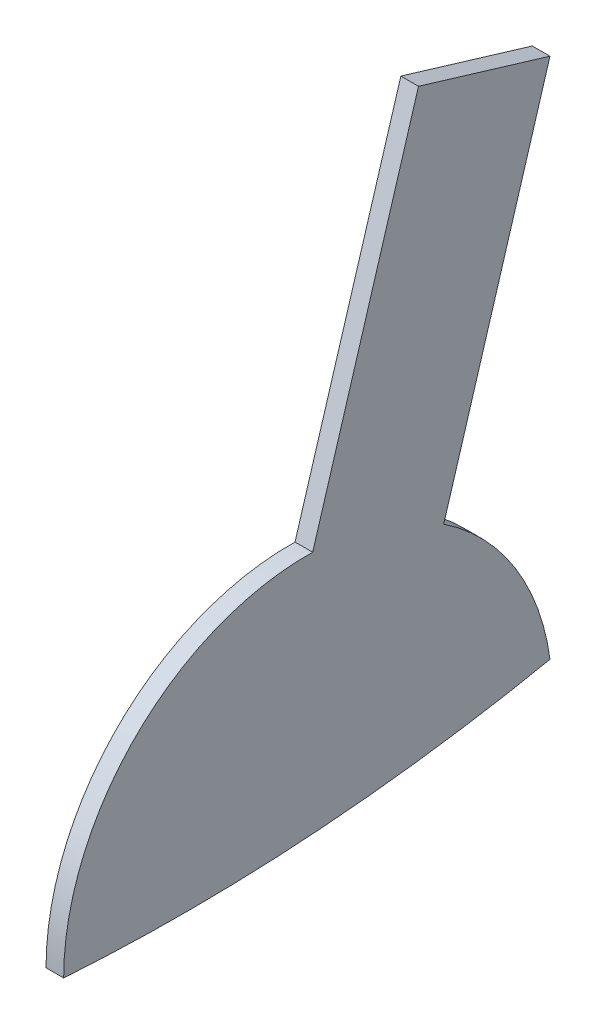
ISO-10303-21;
HEADER;
FILE_DESCRIPTION(('STEP AP214'),'2;1');
FILE_NAME('part.step','',(''),(''),'','','');
FILE_SCHEMA(('AUTOMOTIVE_DESIGN { 1 0 10303 214 1 1 1 1 }'));
ENDSEC;
DATA;
#1=APPLICATION_CONTEXT('core data for automotive mechanical design processes');
#2=APPLICATION_PROTOCOL_DEFINITION('international standard','automotive_design',2000,#1);
#3=PRODUCT_CONTEXT('',#1,'mechanical');
#4=PRODUCT('Part','Part','',(#3));
#5=PRODUCT_RELATED_PRODUCT_CATEGORY('part','',(#4));
#6=PRODUCT_DEFINITION_FORMATION('','',#4);
#7=PRODUCT_DEFINITION_CONTEXT('part definition',#1,'design');
#8=PRODUCT_DEFINITION('design','',#6,#7);
#9=PRODUCT_DEFINITION_SHAPE('','',#8);
#10=(LENGTH_UNIT() NAMED_UNIT(*) SI_UNIT(.MILLI.,.METRE.));
#11=(NAMED_UNIT(*) PLANE_ANGLE_UNIT() SI_UNIT($,.RADIAN.));
#12=(NAMED_UNIT(*) SI_UNIT($,.STERADIAN.) SOLID_ANGLE_UNIT());
#13=UNCERTAINTY_MEASURE_WITH_UNIT(LENGTH_MEASURE(1.E-05),#10,'distance_accuracy_value','');
#14=(GEOMETRIC_REPRESENTATION_CONTEXT(3) GLOBAL_UNCERTAINTY_ASSIGNED_CONTEXT((#13)) GLOBAL_UNIT_ASSIGNED_CONTEXT((#10,
#11,#12)) REPRESENTATION_CONTEXT('',''));
#15=CARTESIAN_POINT('',(0.,0.,0.));
#16=DIRECTION('',(0.,0.,1.));
#17=DIRECTION('',(1.,0.,0.));
#18=AXIS2_PLACEMENT_3D('',#15,#16,#17);
#19=CARTESIAN_POINT('',(-1.5,94.3547100362037,-41.1404397093335));
#20=DIRECTION('',(0.,0.957335683944895,-0.288978179532228));
#21=DIRECTION('',(0.,0.288978179532228,0.957335683944895));
#22=AXIS2_PLACEMENT_3D('',#19,#20,#21);
#23=PLANE('',#22);
#24=DIRECTION('',(0.,0.288978179532228,0.957335683944895));
#25=VECTOR('',#24,1.);
#26=CARTESIAN_POINT('',(1.5,94.3547100362037,-41.1404397093335));
#27=LINE('',#26,#25);
#28=CARTESIAN_POINT('',(1.5,94.3547100362037,-41.1404397093335));
#29=VERTEX_POINT('',#28);
#30=CARTESIAN_POINT('',(1.5,101.100096823698,-18.7941176301657));
#31=VERTEX_POINT('',#30);
#32=EDGE_CURVE('E148',#29,#31,#27,.T.);
#33=ORIENTED_EDGE('',*,*,#32,.F.);
#34=DIRECTION('',(1.,0.,0.));
#35=VECTOR('',#34,1.);
#36=CARTESIAN_POINT('',(-1.5,94.3547100362037,-41.1404397093335));
#37=LINE('',#36,#35);
#38=CARTESIAN_POINT('',(-1.5,94.3547100362037,-41.1404397093335));
#39=VERTEX_POINT('',#38);
#40=EDGE_CURVE('E11',#39,#29,#37,.T.);
#41=ORIENTED_EDGE('',*,*,#40,.F.);
#42=DIRECTION('',(0.,0.288978179532228,0.957335683944895));
#43=VECTOR('',#42,1.);
#44=CARTESIAN_POINT('',(-1.5,94.3547100362037,-41.1404397093335));
#45=LINE('',#44,#43);
#46=CARTESIAN_POINT('',(-1.5,101.100096823698,-18.7941176301657));
#47=VERTEX_POINT('',#46);
#48=EDGE_CURVE('E155',#39,#47,#45,.T.);
#49=ORIENTED_EDGE('',*,*,#48,.T.);
#50=DIRECTION('',(1.,0.,0.));
#51=VECTOR('',#50,1.);
#52=CARTESIAN_POINT('',(-1.5,101.100096823698,-18.7941176301657));
#53=LINE('',#52,#51);
#54=EDGE_CURVE('E40',#47,#31,#53,.T.);
#55=ORIENTED_EDGE('',*,*,#54,.T.);
#56=EDGE_LOOP('',(#33,#41,#49,#55));
#57=FACE_BOUND('',#56,.T.);
#58=ADVANCED_FACE('F37',(#57),#23,.T.);
#59=CARTESIAN_POINT('',(-1.5,94.3547100362037,-41.1404397093335));
#60=DIRECTION('',(0.,-0.288978179532228,-0.957335683944895));
#61=DIRECTION('',(0.,0.957335683944895,-0.288978179532228));
#62=AXIS2_PLACEMENT_3D('',#59,#60,#61);
#63=PLANE('',#62);
#64=DIRECTION('',(0.,0.957335683944895,-0.288978179532228));
#65=VECTOR('',#64,1.);
#66=CARTESIAN_POINT('',(1.5,94.3547100362037,-41.1404397093335));
#67=LINE('',#66,#65);
#68=CARTESIAN_POINT('',(1.5,34.5120051669846,-23.0765189745177));
#69=VERTEX_POINT('',#68);
#70=EDGE_CURVE('E154',#69,#29,#67,.T.);
#71=ORIENTED_EDGE('',*,*,#70,.F.);
#72=DIRECTION('',(1.,0.,0.));
#73=VECTOR('',#72,1.);
#74=CARTESIAN_POINT('',(-1.5,34.5120051669846,-23.0765189745177));
#75=LINE('',#74,#73);
#76=CARTESIAN_POINT('',(-1.5,34.5120051669846,-23.0765189745177));
#77=VERTEX_POINT('',#76);
#78=EDGE_CURVE('E46',#77,#69,#75,.T.);
#79=ORIENTED_EDGE('',*,*,#78,.F.);
#80=DIRECTION('',(0.,0.957335683944895,-0.288978179532228));
#81=VECTOR('',#80,1.);
#82=CARTESIAN_POINT('',(-1.5,94.3547100362037,-41.1404397093335));
#83=LINE('',#82,#81);
#84=EDGE_CURVE('E112',#77,#39,#83,.T.);
#85=ORIENTED_EDGE('',*,*,#84,.T.);
#86=ORIENTED_EDGE('',*,*,#40,.T.);
#87=EDGE_LOOP('',(#71,#79,#85,#86));
#88=FACE_BOUND('',#87,.T.);
#89=ADVANCED_FACE('F143',(#88),#63,.T.);
#90=CARTESIAN_POINT('',(-1.5,0.,0.));
#91=DIRECTION('',(1.,0.,0.));
#92=DIRECTION('',(0.,0.,-1.));
#93=AXIS2_PLACEMENT_3D('',#90,#91,#92);
#94=CYLINDRICAL_SURFACE('',#93,41.5163128014429);
#95=CARTESIAN_POINT('',(1.5,0.,0.));
#96=DIRECTION('',(1.,0.,0.));
#97=DIRECTION('',(0.,0.,-1.));
#98=AXIS2_PLACEMENT_3D('',#95,#96,#97);
#99=CIRCLE('',#98,41.5163128014429);
#100=CARTESIAN_POINT('',(1.5,5.57390788854116,-41.1404397093335));
#101=VERTEX_POINT('',#100);
#102=EDGE_CURVE('E99',#101,#69,#99,.T.);
#103=ORIENTED_EDGE('',*,*,#102,.F.);
#104=DIRECTION('',(1.,0.,0.));
#105=VECTOR('',#104,1.);
#106=CARTESIAN_POINT('',(-1.5,5.57390788854116,-41.1404397093335));
#107=LINE('',#106,#105);
#108=CARTESIAN_POINT('',(-1.5,5.57390788854116,-41.1404397093335));
#109=VERTEX_POINT('',#108);
#110=EDGE_CURVE('E94',#109,#101,#107,.T.);
#111=ORIENTED_EDGE('',*,*,#110,.F.);
#112=CARTESIAN_POINT('',(-1.5,0.,0.));
#113=DIRECTION('',(1.,0.,0.));
#114=DIRECTION('',(0.,0.,-1.));
#115=AXIS2_PLACEMENT_3D('',#112,#113,#114);
#116=CIRCLE('',#115,41.5163128014429);
#117=EDGE_CURVE('E97',#109,#77,#116,.T.);
#118=ORIENTED_EDGE('',*,*,#117,.T.);
#119=ORIENTED_EDGE('',*,*,#78,.T.);
#120=EDGE_LOOP('',(#103,#111,#118,#119));
#121=FACE_BOUND('',#120,.T.);
#122=ADVANCED_FACE('F96',(#121),#94,.T.);
#123=CARTESIAN_POINT('',(-1.5,0.,41.5163128014429));
#124=CARTESIAN_POINT('',(-1.5,-2.78695394427058,-0.187936546054665));
#125=CARTESIAN_POINT('',(-1.5,5.57390788854116,-41.1404397093335));
#126=B_SPLINE_CURVE_WITH_KNOTS('',2,(#123,#124,#125),.UNSPECIFIED.,.F.,.F.,(3,3),(0.,1.),.UNSPECIFIED.);
#127=DIRECTION('',(1.,0.,0.));
#128=VECTOR('',#127,1.);
#129=SURFACE_OF_LINEAR_EXTRUSION('',#126,#128);
#130=CARTESIAN_POINT('',(1.5,0.,41.5163128014429));
#131=CARTESIAN_POINT('',(1.5,-2.78695394427058,-0.187936546054665));
#132=CARTESIAN_POINT('',(1.5,5.57390788854116,-41.1404397093335));
#133=B_SPLINE_CURVE_WITH_KNOTS('',2,(#130,#131,#132),.UNSPECIFIED.,.F.,.F.,(3,3),(0.,1.),.UNSPECIFIED.);
#134=CARTESIAN_POINT('',(1.5,0.,41.5163128014429));
#135=VERTEX_POINT('',#134);
#136=EDGE_CURVE('E158',#135,#101,#133,.T.);
#137=ORIENTED_EDGE('',*,*,#136,.F.);
#138=DIRECTION('',(1.,0.,0.));
#139=VECTOR('',#138,1.);
#140=CARTESIAN_POINT('',(-1.5,0.,41.5163128014429));
#141=LINE('',#140,#139);
#142=CARTESIAN_POINT('',(-1.5,0.,41.5163128014429));
#143=VERTEX_POINT('',#142);
#144=EDGE_CURVE('E104',#143,#135,#141,.T.);
#145=ORIENTED_EDGE('',*,*,#144,.F.);
#146=EDGE_CURVE('E110',#143,#109,#126,.T.);
#147=ORIENTED_EDGE('',*,*,#146,.T.);
#148=ORIENTED_EDGE('',*,*,#110,.T.);
#149=EDGE_LOOP('',(#137,#145,#147,#148));
#150=FACE_BOUND('',#149,.T.);
#151=ADVANCED_FACE('F114',(#150),#129,.T.);
#152=CARTESIAN_POINT('',(-1.5,0.,0.));
#153=DIRECTION('',(1.,0.,0.));
#154=DIRECTION('',(0.,0.,-1.));
#155=AXIS2_PLACEMENT_3D('',#152,#153,#154);
#156=CYLINDRICAL_SURFACE('',#155,41.5163128014429);
#157=CARTESIAN_POINT('',(1.5,0.,0.));
#158=DIRECTION('',(1.,0.,0.));
#159=DIRECTION('',(0.,0.,-1.));
#160=AXIS2_PLACEMENT_3D('',#157,#158,#159);
#161=CIRCLE('',#160,41.5163128014429);
#162=CARTESIAN_POINT('',(1.5,41.5084883546212,-0.805992023241881));
#163=VERTEX_POINT('',#162);
#164=EDGE_CURVE('E167',#163,#135,#161,.T.);
#165=ORIENTED_EDGE('',*,*,#164,.F.);
#166=DIRECTION('',(1.,0.,0.));
#167=VECTOR('',#166,1.);
#168=CARTESIAN_POINT('',(-1.5,41.5084883546212,-0.805992023241881));
#169=LINE('',#168,#167);
#170=CARTESIAN_POINT('',(-1.5,41.5084883546212,-0.805992023241881));
#171=VERTEX_POINT('',#170);
#172=EDGE_CURVE('E163',#171,#163,#169,.T.);
#173=ORIENTED_EDGE('',*,*,#172,.F.);
#174=CARTESIAN_POINT('',(-1.5,0.,0.));
#175=DIRECTION('',(1.,0.,0.));
#176=DIRECTION('',(0.,0.,-1.));
#177=AXIS2_PLACEMENT_3D('',#174,#175,#176);
#178=CIRCLE('',#177,41.5163128014429);
#179=EDGE_CURVE('E115',#171,#143,#178,.T.);
#180=ORIENTED_EDGE('',*,*,#179,.T.);
#181=ORIENTED_EDGE('',*,*,#144,.T.);
#182=EDGE_LOOP('',(#165,#173,#180,#181));
#183=FACE_BOUND('',#182,.T.);
#184=ADVANCED_FACE('F131',(#183),#156,.T.);
#185=CARTESIAN_POINT('',(-1.5,41.5084883546212,-0.805992023241886));
#186=DIRECTION('',(0.,0.288978179532228,0.957335683944895));
#187=DIRECTION('',(0.,-0.957335683944895,0.288978179532228));
#188=AXIS2_PLACEMENT_3D('',#185,#186,#187);
#189=PLANE('',#188);
#190=DIRECTION('',(0.,-0.957335683944895,0.288978179532228));
#191=VECTOR('',#190,1.);
#192=CARTESIAN_POINT('',(1.5,41.5084883546212,-0.805992023241886));
#193=LINE('',#192,#191);
#194=EDGE_CURVE('E152',#31,#163,#193,.T.);
#195=ORIENTED_EDGE('',*,*,#194,.F.);
#196=ORIENTED_EDGE('',*,*,#54,.F.);
#197=DIRECTION('',(0.,-0.957335683944895,0.288978179532228));
#198=VECTOR('',#197,1.);
#199=CARTESIAN_POINT('',(-1.5,41.5084883546212,-0.805992023241886));
#200=LINE('',#199,#198);
#201=EDGE_CURVE('E117',#47,#171,#200,.T.);
#202=ORIENTED_EDGE('',*,*,#201,.T.);
#203=ORIENTED_EDGE('',*,*,#172,.T.);
#204=EDGE_LOOP('',(#195,#196,#202,#203));
#205=FACE_BOUND('',#204,.T.);
#206=ADVANCED_FACE('F134',(#205),#189,.T.);
#207=CARTESIAN_POINT('',(-1.5,0.,0.));
#208=DIRECTION('',(1.,0.,0.));
#209=DIRECTION('',(0.,0.,-1.));
#210=AXIS2_PLACEMENT_3D('',#207,#208,#209);
#211=PLANE('',#210);
#212=ORIENTED_EDGE('',*,*,#48,.F.);
#213=ORIENTED_EDGE('',*,*,#84,.F.);
#214=ORIENTED_EDGE('',*,*,#117,.F.);
#215=ORIENTED_EDGE('',*,*,#146,.F.);
#216=ORIENTED_EDGE('',*,*,#179,.F.);
#217=ORIENTED_EDGE('',*,*,#201,.F.);
#218=EDGE_LOOP('',(#212,#213,#214,#215,#216,#217));
#219=FACE_BOUND('',#218,.T.);
#220=ADVANCED_FACE('F108',(#219),#211,.F.);
#221=CARTESIAN_POINT('',(1.5,0.,0.));
#222=DIRECTION('',(1.,0.,0.));
#223=DIRECTION('',(0.,0.,-1.));
#224=AXIS2_PLACEMENT_3D('',#221,#222,#223);
#225=PLANE('',#224);
#226=ORIENTED_EDGE('',*,*,#32,.T.);
#227=ORIENTED_EDGE('',*,*,#194,.T.);
#228=ORIENTED_EDGE('',*,*,#164,.T.);
#229=ORIENTED_EDGE('',*,*,#136,.T.);
#230=ORIENTED_EDGE('',*,*,#102,.T.);
#231=ORIENTED_EDGE('',*,*,#70,.T.);
#232=EDGE_LOOP('',(#226,#227,#228,#229,#230,#231));
#233=FACE_BOUND('',#232,.T.);
#234=ADVANCED_FACE('F140',(#233),#225,.T.);
#235=CLOSED_SHELL('',(#58,#89,#122,#151,#184,#206,#220,#234));
#236=MANIFOLD_SOLID_BREP('B2',#235);
#237=ADVANCED_BREP_SHAPE_REPRESENTATION('',(#18,#236),#14);
#238=SHAPE_DEFINITION_REPRESENTATION(#9,#237);
ENDSEC;
END-ISO-10303-21;
